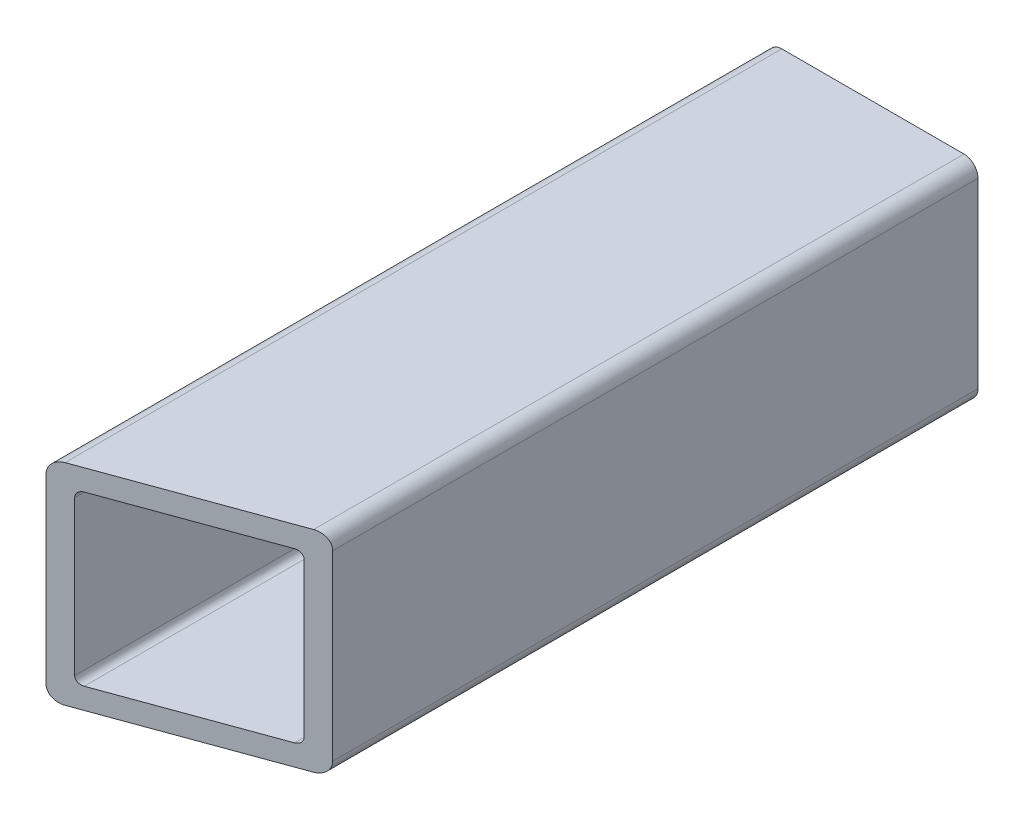
ISO-10303-21;
HEADER;
FILE_DESCRIPTION(('STEP AP214'),'2;1');
FILE_NAME('part.step','',(''),(''),'','','');
FILE_SCHEMA(('AUTOMOTIVE_DESIGN { 1 0 10303 214 1 1 1 1 }'));
ENDSEC;
DATA;
#1=APPLICATION_CONTEXT('core data for automotive mechanical design processes');
#2=APPLICATION_PROTOCOL_DEFINITION('international standard','automotive_design',2000,#1);
#3=PRODUCT_CONTEXT('',#1,'mechanical');
#4=PRODUCT('Part','Part','',(#3));
#5=PRODUCT_RELATED_PRODUCT_CATEGORY('part','',(#4));
#6=PRODUCT_DEFINITION_FORMATION('','',#4);
#7=PRODUCT_DEFINITION_CONTEXT('part definition',#1,'design');
#8=PRODUCT_DEFINITION('design','',#6,#7);
#9=PRODUCT_DEFINITION_SHAPE('','',#8);
#10=(LENGTH_UNIT() NAMED_UNIT(*) SI_UNIT(.MILLI.,.METRE.));
#11=(NAMED_UNIT(*) PLANE_ANGLE_UNIT() SI_UNIT($,.RADIAN.));
#12=(NAMED_UNIT(*) SI_UNIT($,.STERADIAN.) SOLID_ANGLE_UNIT());
#13=UNCERTAINTY_MEASURE_WITH_UNIT(LENGTH_MEASURE(1.E-05),#10,'distance_accuracy_value','');
#14=(GEOMETRIC_REPRESENTATION_CONTEXT(3) GLOBAL_UNCERTAINTY_ASSIGNED_CONTEXT((#13)) GLOBAL_UNIT_ASSIGNED_CONTEXT((#10,
#11,#12)) REPRESENTATION_CONTEXT('',''));
#15=CARTESIAN_POINT('',(0.,0.,0.));
#16=DIRECTION('',(0.,0.,1.));
#17=DIRECTION('',(1.,0.,0.));
#18=AXIS2_PLACEMENT_3D('',#15,#16,#17);
#19=CARTESIAN_POINT('',(-13.,-0.999999999999999,0.));
#20=DIRECTION('',(0.,0.,1.));
#21=DIRECTION('',(1.,0.,0.));
#22=AXIS2_PLACEMENT_3D('',#19,#20,#21);
#23=PLANE('',#22);
#24=CARTESIAN_POINT('',(-13.,-0.999999999999999,0.));
#25=DIRECTION('',(0.,0.,1.));
#26=DIRECTION('',(1.,0.,0.));
#27=AXIS2_PLACEMENT_3D('',#24,#25,#26);
#28=CIRCLE('',#27,2.);
#29=CARTESIAN_POINT('',(-15.,-0.999999999999999,0.));
#30=VERTEX_POINT('',#29);
#31=CARTESIAN_POINT('',(-13.,-3.,0.));
#32=VERTEX_POINT('',#31);
#33=EDGE_CURVE('E172',#30,#32,#28,.T.);
#34=ORIENTED_EDGE('',*,*,#33,.F.);
#35=DIRECTION('',(0.,-1.,0.));
#36=VECTOR('',#35,1.);
#37=CARTESIAN_POINT('',(-15.,-0.999999999999999,0.));
#38=LINE('',#37,#36);
#39=CARTESIAN_POINT('',(-15.,25.,0.));
#40=VERTEX_POINT('',#39);
#41=EDGE_CURVE('E188',#40,#30,#38,.T.);
#42=ORIENTED_EDGE('',*,*,#41,.F.);
#43=CARTESIAN_POINT('',(-13.,25.,0.));
#44=DIRECTION('',(0.,0.,1.));
#45=DIRECTION('',(1.,0.,0.));
#46=AXIS2_PLACEMENT_3D('',#43,#44,#45);
#47=CIRCLE('',#46,2.);
#48=CARTESIAN_POINT('',(-13.,27.,0.));
#49=VERTEX_POINT('',#48);
#50=EDGE_CURVE('E190',#49,#40,#47,.T.);
#51=ORIENTED_EDGE('',*,*,#50,.F.);
#52=DIRECTION('',(-1.,0.,0.));
#53=VECTOR('',#52,1.);
#54=CARTESIAN_POINT('',(-13.,27.,0.));
#55=LINE('',#54,#53);
#56=CARTESIAN_POINT('',(13.,27.,0.));
#57=VERTEX_POINT('',#56);
#58=EDGE_CURVE('E192',#57,#49,#55,.T.);
#59=ORIENTED_EDGE('',*,*,#58,.F.);
#60=CARTESIAN_POINT('',(13.,25.,0.));
#61=DIRECTION('',(0.,0.,1.));
#62=DIRECTION('',(1.,0.,0.));
#63=AXIS2_PLACEMENT_3D('',#60,#61,#62);
#64=CIRCLE('',#63,2.);
#65=CARTESIAN_POINT('',(15.,25.,0.));
#66=VERTEX_POINT('',#65);
#67=EDGE_CURVE('E195',#66,#57,#64,.T.);
#68=ORIENTED_EDGE('',*,*,#67,.F.);
#69=DIRECTION('',(0.,1.,0.));
#70=VECTOR('',#69,1.);
#71=CARTESIAN_POINT('',(15.,-0.999999999999999,0.));
#72=LINE('',#71,#70);
#73=CARTESIAN_POINT('',(15.,-0.999999999999999,0.));
#74=VERTEX_POINT('',#73);
#75=EDGE_CURVE('E198',#74,#66,#72,.T.);
#76=ORIENTED_EDGE('',*,*,#75,.F.);
#77=CARTESIAN_POINT('',(13.,-0.999999999999999,0.));
#78=DIRECTION('',(0.,0.,1.));
#79=DIRECTION('',(1.,0.,0.));
#80=AXIS2_PLACEMENT_3D('',#77,#78,#79);
#81=CIRCLE('',#80,2.);
#82=CARTESIAN_POINT('',(13.,-3.,0.));
#83=VERTEX_POINT('',#82);
#84=EDGE_CURVE('E201',#83,#74,#81,.T.);
#85=ORIENTED_EDGE('',*,*,#84,.F.);
#86=DIRECTION('',(1.,0.,0.));
#87=VECTOR('',#86,1.);
#88=CARTESIAN_POINT('',(-13.,-3.,0.));
#89=LINE('',#88,#87);
#90=EDGE_CURVE('E204',#32,#83,#89,.T.);
#91=ORIENTED_EDGE('',*,*,#90,.F.);
#92=EDGE_LOOP('',(#34,#42,#51,#59,#68,#76,#85,#91));
#93=FACE_BOUND('',#92,.T.);
#94=CARTESIAN_POINT('',(-11.,1.,0.));
#95=DIRECTION('',(0.,0.,1.));
#96=DIRECTION('',(1.,0.,0.));
#97=AXIS2_PLACEMENT_3D('',#94,#95,#96);
#98=CIRCLE('',#97,1.);
#99=CARTESIAN_POINT('',(-12.,1.,0.));
#100=VERTEX_POINT('',#99);
#101=CARTESIAN_POINT('',(-11.,0.,0.));
#102=VERTEX_POINT('',#101);
#103=EDGE_CURVE('E159',#100,#102,#98,.T.);
#104=ORIENTED_EDGE('',*,*,#103,.T.);
#105=DIRECTION('',(1.,0.,0.));
#106=VECTOR('',#105,1.);
#107=CARTESIAN_POINT('',(-11.,0.,0.));
#108=LINE('',#107,#106);
#109=CARTESIAN_POINT('',(11.,0.,0.));
#110=VERTEX_POINT('',#109);
#111=EDGE_CURVE('E241',#102,#110,#108,.T.);
#112=ORIENTED_EDGE('',*,*,#111,.T.);
#113=CARTESIAN_POINT('',(11.,1.,0.));
#114=DIRECTION('',(0.,0.,1.));
#115=DIRECTION('',(1.,0.,0.));
#116=AXIS2_PLACEMENT_3D('',#113,#114,#115);
#117=CIRCLE('',#116,1.);
#118=CARTESIAN_POINT('',(12.,1.,0.));
#119=VERTEX_POINT('',#118);
#120=EDGE_CURVE('E238',#110,#119,#117,.T.);
#121=ORIENTED_EDGE('',*,*,#120,.T.);
#122=DIRECTION('',(0.,1.,0.));
#123=VECTOR('',#122,1.);
#124=CARTESIAN_POINT('',(12.,1.,0.));
#125=LINE('',#124,#123);
#126=CARTESIAN_POINT('',(12.,23.,0.));
#127=VERTEX_POINT('',#126);
#128=EDGE_CURVE('E235',#119,#127,#125,.T.);
#129=ORIENTED_EDGE('',*,*,#128,.T.);
#130=CARTESIAN_POINT('',(11.,23.,0.));
#131=DIRECTION('',(0.,0.,1.));
#132=DIRECTION('',(1.,0.,0.));
#133=AXIS2_PLACEMENT_3D('',#130,#131,#132);
#134=CIRCLE('',#133,1.);
#135=CARTESIAN_POINT('',(11.,24.,0.));
#136=VERTEX_POINT('',#135);
#137=EDGE_CURVE('E232',#127,#136,#134,.T.);
#138=ORIENTED_EDGE('',*,*,#137,.T.);
#139=DIRECTION('',(-1.,0.,0.));
#140=VECTOR('',#139,1.);
#141=CARTESIAN_POINT('',(-11.,24.,0.));
#142=LINE('',#141,#140);
#143=CARTESIAN_POINT('',(-11.,24.,0.));
#144=VERTEX_POINT('',#143);
#145=EDGE_CURVE('E229',#136,#144,#142,.T.);
#146=ORIENTED_EDGE('',*,*,#145,.T.);
#147=CARTESIAN_POINT('',(-11.,23.,0.));
#148=DIRECTION('',(0.,0.,1.));
#149=DIRECTION('',(1.,0.,0.));
#150=AXIS2_PLACEMENT_3D('',#147,#148,#149);
#151=CIRCLE('',#150,1.);
#152=CARTESIAN_POINT('',(-12.,23.,0.));
#153=VERTEX_POINT('',#152);
#154=EDGE_CURVE('E226',#144,#153,#151,.T.);
#155=ORIENTED_EDGE('',*,*,#154,.T.);
#156=DIRECTION('',(0.,-1.,0.));
#157=VECTOR('',#156,1.);
#158=CARTESIAN_POINT('',(-12.,1.,0.));
#159=LINE('',#158,#157);
#160=EDGE_CURVE('E223',#153,#100,#159,.T.);
#161=ORIENTED_EDGE('',*,*,#160,.T.);
#162=EDGE_LOOP('',(#104,#112,#121,#129,#138,#146,#155,#161));
#163=FACE_BOUND('',#162,.T.);
#164=ADVANCED_FACE('F36',(#93,#163),#23,.F.);
#165=CARTESIAN_POINT('',(-13.,-0.999999999999999,103.));
#166=DIRECTION('',(0.,0.,-1.));
#167=DIRECTION('',(-1.,0.,0.));
#168=AXIS2_PLACEMENT_3D('',#165,#166,#167);
#169=CYLINDRICAL_SURFACE('',#168,2.);
#170=DIRECTION('',(0.,0.,-1.));
#171=VECTOR('',#170,1.);
#172=CARTESIAN_POINT('',(-13.,-3.,103.));
#173=LINE('',#172,#171);
#174=CARTESIAN_POINT('',(-13.,-3.,102.272059531468));
#175=VERTEX_POINT('',#174);
#176=EDGE_CURVE('E44',#175,#32,#173,.T.);
#177=ORIENTED_EDGE('',*,*,#176,.F.);
#178=CARTESIAN_POINT('',(-13.,-0.999999999999999,102.272059531468));
#179=DIRECTION('',(-0.342020143325669,0.,-0.939692620785908));
#180=DIRECTION('',(0.939692620785908,0.,-0.342020143325669));
#181=AXIS2_PLACEMENT_3D('',#178,#179,#180);
#182=ELLIPSE('',#181,2.12835554495182,2.);
#183=CARTESIAN_POINT('',(-15.,-1.,103.));
#184=VERTEX_POINT('',#183);
#185=EDGE_CURVE('E148',#175,#184,#182,.T.);
#186=ORIENTED_EDGE('',*,*,#185,.T.);
#187=DIRECTION('',(0.,0.,-1.));
#188=VECTOR('',#187,1.);
#189=CARTESIAN_POINT('',(-15.,-0.999999999999999,103.));
#190=LINE('',#189,#188);
#191=EDGE_CURVE('E186',#184,#30,#190,.T.);
#192=ORIENTED_EDGE('',*,*,#191,.T.);
#193=ORIENTED_EDGE('',*,*,#33,.T.);
#194=EDGE_LOOP('',(#177,#186,#192,#193));
#195=FACE_BOUND('',#194,.T.);
#196=ADVANCED_FACE('F38',(#195),#169,.T.);
#197=CARTESIAN_POINT('',(-13.,-3.,103.));
#198=DIRECTION('',(0.,1.,0.));
#199=DIRECTION('',(0.,0.,1.));
#200=AXIS2_PLACEMENT_3D('',#197,#198,#199);
#201=PLANE('',#200);
#202=DIRECTION('',(0.,0.,-1.));
#203=VECTOR('',#202,1.);
#204=CARTESIAN_POINT('',(13.,-3.,103.));
#205=LINE('',#204,#203);
#206=CARTESIAN_POINT('',(13.,-3.,92.8088334405463));
#207=VERTEX_POINT('',#206);
#208=EDGE_CURVE('E167',#207,#83,#205,.T.);
#209=ORIENTED_EDGE('',*,*,#208,.F.);
#210=DIRECTION('',(0.939692620785908,0.,-0.342020143325669));
#211=VECTOR('',#210,1.);
#212=CARTESIAN_POINT('',(-15.,-3.,103.));
#213=LINE('',#212,#211);
#214=EDGE_CURVE('E151',#175,#207,#213,.T.);
#215=ORIENTED_EDGE('',*,*,#214,.F.);
#216=ORIENTED_EDGE('',*,*,#176,.T.);
#217=ORIENTED_EDGE('',*,*,#90,.T.);
#218=EDGE_LOOP('',(#209,#215,#216,#217));
#219=FACE_BOUND('',#218,.T.);
#220=ADVANCED_FACE('F164',(#219),#201,.F.);
#221=CARTESIAN_POINT('',(13.,-0.999999999999999,103.));
#222=DIRECTION('',(0.,0.,-1.));
#223=DIRECTION('',(-1.,0.,0.));
#224=AXIS2_PLACEMENT_3D('',#221,#222,#223);
#225=CYLINDRICAL_SURFACE('',#224,2.);
#226=DIRECTION('',(0.,0.,-1.));
#227=VECTOR('',#226,1.);
#228=CARTESIAN_POINT('',(15.,-0.999999999999999,103.));
#229=LINE('',#228,#227);
#230=CARTESIAN_POINT('',(15.,-0.999999999999999,92.0808929720139));
#231=VERTEX_POINT('',#230);
#232=EDGE_CURVE('E173',#231,#74,#229,.T.);
#233=ORIENTED_EDGE('',*,*,#232,.F.);
#234=CARTESIAN_POINT('',(13.,-0.999999999999999,92.8088334405463));
#235=DIRECTION('',(-0.342020143325669,0.,-0.939692620785908));
#236=DIRECTION('',(0.939692620785908,0.,-0.342020143325669));
#237=AXIS2_PLACEMENT_3D('',#234,#235,#236);
#238=ELLIPSE('',#237,2.12835554495183,2.);
#239=EDGE_CURVE('E160',#231,#207,#238,.T.);
#240=ORIENTED_EDGE('',*,*,#239,.T.);
#241=ORIENTED_EDGE('',*,*,#208,.T.);
#242=ORIENTED_EDGE('',*,*,#84,.T.);
#243=EDGE_LOOP('',(#233,#240,#241,#242));
#244=FACE_BOUND('',#243,.T.);
#245=ADVANCED_FACE('F341',(#244),#225,.T.);
#246=CARTESIAN_POINT('',(15.,-0.999999999999999,103.));
#247=DIRECTION('',(-1.,0.,0.));
#248=DIRECTION('',(0.,0.,1.));
#249=AXIS2_PLACEMENT_3D('',#246,#247,#248);
#250=PLANE('',#249);
#251=DIRECTION('',(0.,0.,-1.));
#252=VECTOR('',#251,1.);
#253=CARTESIAN_POINT('',(15.,25.,103.));
#254=LINE('',#253,#252);
#255=CARTESIAN_POINT('',(15.,25.,92.0808929720139));
#256=VERTEX_POINT('',#255);
#257=EDGE_CURVE('E177',#256,#66,#254,.T.);
#258=ORIENTED_EDGE('',*,*,#257,.F.);
#259=DIRECTION('',(0.,-1.,0.));
#260=VECTOR('',#259,1.);
#261=CARTESIAN_POINT('',(15.,-0.999999999999999,92.0808929720139));
#262=LINE('',#261,#260);
#263=EDGE_CURVE('E247',#256,#231,#262,.T.);
#264=ORIENTED_EDGE('',*,*,#263,.T.);
#265=ORIENTED_EDGE('',*,*,#232,.T.);
#266=ORIENTED_EDGE('',*,*,#75,.T.);
#267=EDGE_LOOP('',(#258,#264,#265,#266));
#268=FACE_BOUND('',#267,.T.);
#269=ADVANCED_FACE('F337',(#268),#250,.F.);
#270=CARTESIAN_POINT('',(13.,25.,103.));
#271=DIRECTION('',(0.,0.,-1.));
#272=DIRECTION('',(-1.,0.,0.));
#273=AXIS2_PLACEMENT_3D('',#270,#271,#272);
#274=CYLINDRICAL_SURFACE('',#273,2.);
#275=DIRECTION('',(0.,0.,-1.));
#276=VECTOR('',#275,1.);
#277=CARTESIAN_POINT('',(13.,27.,103.));
#278=LINE('',#277,#276);
#279=CARTESIAN_POINT('',(13.,27.,92.8088334405463));
#280=VERTEX_POINT('',#279);
#281=EDGE_CURVE('E179',#280,#57,#278,.T.);
#282=ORIENTED_EDGE('',*,*,#281,.F.);
#283=CARTESIAN_POINT('',(13.,25.,92.8088334405463));
#284=DIRECTION('',(-0.342020143325669,0.,-0.939692620785908));
#285=DIRECTION('',(0.939692620785908,0.,-0.342020143325669));
#286=AXIS2_PLACEMENT_3D('',#283,#284,#285);
#287=ELLIPSE('',#286,2.12835554495183,2.);
#288=EDGE_CURVE('E250',#280,#256,#287,.T.);
#289=ORIENTED_EDGE('',*,*,#288,.T.);
#290=ORIENTED_EDGE('',*,*,#257,.T.);
#291=ORIENTED_EDGE('',*,*,#67,.T.);
#292=EDGE_LOOP('',(#282,#289,#290,#291));
#293=FACE_BOUND('',#292,.T.);
#294=ADVANCED_FACE('F333',(#293),#274,.T.);
#295=CARTESIAN_POINT('',(-13.,27.,103.));
#296=DIRECTION('',(0.,-1.,0.));
#297=DIRECTION('',(0.,0.,-1.));
#298=AXIS2_PLACEMENT_3D('',#295,#296,#297);
#299=PLANE('',#298);
#300=DIRECTION('',(0.,0.,-1.));
#301=VECTOR('',#300,1.);
#302=CARTESIAN_POINT('',(-13.,27.,103.));
#303=LINE('',#302,#301);
#304=CARTESIAN_POINT('',(-13.,27.,102.272059531468));
#305=VERTEX_POINT('',#304);
#306=EDGE_CURVE('E181',#305,#49,#303,.T.);
#307=ORIENTED_EDGE('',*,*,#306,.F.);
#308=DIRECTION('',(0.939692620785908,0.,-0.342020143325669));
#309=VECTOR('',#308,1.);
#310=CARTESIAN_POINT('',(-13.233955556881,27.,102.357212390313));
#311=LINE('',#310,#309);
#312=EDGE_CURVE('E253',#305,#280,#311,.T.);
#313=ORIENTED_EDGE('',*,*,#312,.T.);
#314=ORIENTED_EDGE('',*,*,#281,.T.);
#315=ORIENTED_EDGE('',*,*,#58,.T.);
#316=EDGE_LOOP('',(#307,#313,#314,#315));
#317=FACE_BOUND('',#316,.T.);
#318=ADVANCED_FACE('F329',(#317),#299,.F.);
#319=CARTESIAN_POINT('',(-13.,25.,103.));
#320=DIRECTION('',(0.,0.,-1.));
#321=DIRECTION('',(-1.,0.,0.));
#322=AXIS2_PLACEMENT_3D('',#319,#320,#321);
#323=CYLINDRICAL_SURFACE('',#322,2.);
#324=DIRECTION('',(0.,0.,-1.));
#325=VECTOR('',#324,1.);
#326=CARTESIAN_POINT('',(-15.,25.,103.));
#327=LINE('',#326,#325);
#328=CARTESIAN_POINT('',(-15.,25.,103.));
#329=VERTEX_POINT('',#328);
#330=EDGE_CURVE('E183',#329,#40,#327,.T.);
#331=ORIENTED_EDGE('',*,*,#330,.F.);
#332=CARTESIAN_POINT('',(-13.,25.,102.272059531468));
#333=DIRECTION('',(-0.342020143325669,0.,-0.939692620785908));
#334=DIRECTION('',(0.939692620785908,0.,-0.342020143325669));
#335=AXIS2_PLACEMENT_3D('',#332,#333,#334);
#336=ELLIPSE('',#335,2.12835554495183,2.);
#337=EDGE_CURVE('E256',#329,#305,#336,.T.);
#338=ORIENTED_EDGE('',*,*,#337,.T.);
#339=ORIENTED_EDGE('',*,*,#306,.T.);
#340=ORIENTED_EDGE('',*,*,#50,.T.);
#341=EDGE_LOOP('',(#331,#338,#339,#340));
#342=FACE_BOUND('',#341,.T.);
#343=ADVANCED_FACE('F325',(#342),#323,.T.);
#344=CARTESIAN_POINT('',(-15.,-0.999999999999999,103.));
#345=DIRECTION('',(1.,0.,0.));
#346=DIRECTION('',(0.,0.,-1.));
#347=AXIS2_PLACEMENT_3D('',#344,#345,#346);
#348=PLANE('',#347);
#349=ORIENTED_EDGE('',*,*,#41,.T.);
#350=ORIENTED_EDGE('',*,*,#191,.F.);
#351=DIRECTION('',(0.,-1.,0.));
#352=VECTOR('',#351,1.);
#353=CARTESIAN_POINT('',(-15.,-0.999999999999999,103.));
#354=LINE('',#353,#352);
#355=EDGE_CURVE('E154',#329,#184,#354,.T.);
#356=ORIENTED_EDGE('',*,*,#355,.F.);
#357=ORIENTED_EDGE('',*,*,#330,.T.);
#358=EDGE_LOOP('',(#349,#350,#356,#357));
#359=FACE_BOUND('',#358,.T.);
#360=ADVANCED_FACE('F322',(#359),#348,.F.);
#361=CARTESIAN_POINT('',(-11.,1.,103.));
#362=DIRECTION('',(0.,0.,-1.));
#363=DIRECTION('',(-1.,0.,0.));
#364=AXIS2_PLACEMENT_3D('',#361,#362,#363);
#365=CYLINDRICAL_SURFACE('',#364,1.);
#366=CARTESIAN_POINT('',(-11.,1.,101.544119062935));
#367=DIRECTION('',(-0.342020143325669,0.,-0.939692620785908));
#368=DIRECTION('',(0.939692620785908,0.,-0.342020143325669));
#369=AXIS2_PLACEMENT_3D('',#366,#367,#368);
#370=ELLIPSE('',#369,1.06417777247591,1.);
#371=CARTESIAN_POINT('',(-11.,0.,101.544119062935));
#372=VERTEX_POINT('',#371);
#373=CARTESIAN_POINT('',(-12.,1.,101.908089297201));
#374=VERTEX_POINT('',#373);
#375=EDGE_CURVE('E50',#372,#374,#370,.T.);
#376=ORIENTED_EDGE('',*,*,#375,.F.);
#377=DIRECTION('',(0.,0.,-1.));
#378=VECTOR('',#377,1.);
#379=CARTESIAN_POINT('',(-11.,0.,103.));
#380=LINE('',#379,#378);
#381=EDGE_CURVE('E207',#372,#102,#380,.T.);
#382=ORIENTED_EDGE('',*,*,#381,.T.);
#383=ORIENTED_EDGE('',*,*,#103,.F.);
#384=DIRECTION('',(0.,0.,-1.));
#385=VECTOR('',#384,1.);
#386=CARTESIAN_POINT('',(-12.,1.,103.));
#387=LINE('',#386,#385);
#388=EDGE_CURVE('E57',#374,#100,#387,.T.);
#389=ORIENTED_EDGE('',*,*,#388,.F.);
#390=EDGE_LOOP('',(#376,#382,#383,#389));
#391=FACE_BOUND('',#390,.T.);
#392=ADVANCED_FACE('F303',(#391),#365,.F.);
#393=CARTESIAN_POINT('',(-11.,0.,103.));
#394=DIRECTION('',(0.,1.,0.));
#395=DIRECTION('',(-1.,0.,0.));
#396=AXIS2_PLACEMENT_3D('',#393,#394,#395);
#397=PLANE('',#396);
#398=DIRECTION('',(-0.939692620785908,0.,0.342020143325669));
#399=VECTOR('',#398,1.);
#400=CARTESIAN_POINT('',(-11.467911113762,0.,101.714424780627));
#401=LINE('',#400,#399);
#402=CARTESIAN_POINT('',(11.,0.,93.5367739090787));
#403=VERTEX_POINT('',#402);
#404=EDGE_CURVE('E260',#403,#372,#401,.T.);
#405=ORIENTED_EDGE('',*,*,#404,.F.);
#406=DIRECTION('',(0.,0.,-1.));
#407=VECTOR('',#406,1.);
#408=CARTESIAN_POINT('',(11.,0.,103.));
#409=LINE('',#408,#407);
#410=EDGE_CURVE('E210',#403,#110,#409,.T.);
#411=ORIENTED_EDGE('',*,*,#410,.T.);
#412=ORIENTED_EDGE('',*,*,#111,.F.);
#413=ORIENTED_EDGE('',*,*,#381,.F.);
#414=EDGE_LOOP('',(#405,#411,#412,#413));
#415=FACE_BOUND('',#414,.T.);
#416=ADVANCED_FACE('F300',(#415),#397,.T.);
#417=CARTESIAN_POINT('',(11.,1.,103.));
#418=DIRECTION('',(0.,0.,-1.));
#419=DIRECTION('',(-1.,0.,0.));
#420=AXIS2_PLACEMENT_3D('',#417,#418,#419);
#421=CYLINDRICAL_SURFACE('',#420,1.);
#422=CARTESIAN_POINT('',(11.,1.,93.5367739090787));
#423=DIRECTION('',(-0.342020143325669,0.,-0.939692620785908));
#424=DIRECTION('',(0.939692620785908,0.,-0.342020143325669));
#425=AXIS2_PLACEMENT_3D('',#422,#423,#424);
#426=ELLIPSE('',#425,1.06417777247591,1.);
#427=CARTESIAN_POINT('',(12.,1.,93.1728036748125));
#428=VERTEX_POINT('',#427);
#429=EDGE_CURVE('E262',#428,#403,#426,.T.);
#430=ORIENTED_EDGE('',*,*,#429,.F.);
#431=DIRECTION('',(0.,0.,-1.));
#432=VECTOR('',#431,1.);
#433=CARTESIAN_POINT('',(12.,1.,103.));
#434=LINE('',#433,#432);
#435=EDGE_CURVE('E212',#428,#119,#434,.T.);
#436=ORIENTED_EDGE('',*,*,#435,.T.);
#437=ORIENTED_EDGE('',*,*,#120,.F.);
#438=ORIENTED_EDGE('',*,*,#410,.F.);
#439=EDGE_LOOP('',(#430,#436,#437,#438));
#440=FACE_BOUND('',#439,.T.);
#441=ADVANCED_FACE('F295',(#440),#421,.F.);
#442=CARTESIAN_POINT('',(12.,1.,103.));
#443=DIRECTION('',(-1.,0.,0.));
#444=DIRECTION('',(0.,-1.,0.));
#445=AXIS2_PLACEMENT_3D('',#442,#443,#444);
#446=PLANE('',#445);
#447=DIRECTION('',(0.,-1.,0.));
#448=VECTOR('',#447,1.);
#449=CARTESIAN_POINT('',(12.,1.00000000000001,93.1728036748125));
#450=LINE('',#449,#448);
#451=CARTESIAN_POINT('',(12.,23.,93.1728036748125));
#452=VERTEX_POINT('',#451);
#453=EDGE_CURVE('E264',#452,#428,#450,.T.);
#454=ORIENTED_EDGE('',*,*,#453,.F.);
#455=DIRECTION('',(0.,0.,-1.));
#456=VECTOR('',#455,1.);
#457=CARTESIAN_POINT('',(12.,23.,103.));
#458=LINE('',#457,#456);
#459=EDGE_CURVE('E214',#452,#127,#458,.T.);
#460=ORIENTED_EDGE('',*,*,#459,.T.);
#461=ORIENTED_EDGE('',*,*,#128,.F.);
#462=ORIENTED_EDGE('',*,*,#435,.F.);
#463=EDGE_LOOP('',(#454,#460,#461,#462));
#464=FACE_BOUND('',#463,.T.);
#465=ADVANCED_FACE('F292',(#464),#446,.T.);
#466=CARTESIAN_POINT('',(11.,23.,103.));
#467=DIRECTION('',(0.,0.,-1.));
#468=DIRECTION('',(-1.,0.,0.));
#469=AXIS2_PLACEMENT_3D('',#466,#467,#468);
#470=CYLINDRICAL_SURFACE('',#469,1.);
#471=CARTESIAN_POINT('',(11.,23.,93.5367739090787));
#472=DIRECTION('',(-0.342020143325669,0.,-0.939692620785908));
#473=DIRECTION('',(0.939692620785908,0.,-0.342020143325669));
#474=AXIS2_PLACEMENT_3D('',#471,#472,#473);
#475=ELLIPSE('',#474,1.06417777247592,1.);
#476=CARTESIAN_POINT('',(11.,24.,93.5367739090787));
#477=VERTEX_POINT('',#476);
#478=EDGE_CURVE('E266',#477,#452,#475,.T.);
#479=ORIENTED_EDGE('',*,*,#478,.F.);
#480=DIRECTION('',(0.,0.,-1.));
#481=VECTOR('',#480,1.);
#482=CARTESIAN_POINT('',(11.,24.,103.));
#483=LINE('',#482,#481);
#484=EDGE_CURVE('E216',#477,#136,#483,.T.);
#485=ORIENTED_EDGE('',*,*,#484,.T.);
#486=ORIENTED_EDGE('',*,*,#137,.F.);
#487=ORIENTED_EDGE('',*,*,#459,.F.);
#488=EDGE_LOOP('',(#479,#485,#486,#487));
#489=FACE_BOUND('',#488,.T.);
#490=ADVANCED_FACE('F287',(#489),#470,.F.);
#491=CARTESIAN_POINT('',(-11.,24.,103.));
#492=DIRECTION('',(0.,-1.,0.));
#493=DIRECTION('',(1.,0.,0.));
#494=AXIS2_PLACEMENT_3D('',#491,#492,#493);
#495=PLANE('',#494);
#496=DIRECTION('',(0.939692620785908,0.,-0.342020143325669));
#497=VECTOR('',#496,1.);
#498=CARTESIAN_POINT('',(-11.467911113762,24.,101.714424780627));
#499=LINE('',#498,#497);
#500=CARTESIAN_POINT('',(-11.,24.,101.544119062935));
#501=VERTEX_POINT('',#500);
#502=EDGE_CURVE('E268',#501,#477,#499,.T.);
#503=ORIENTED_EDGE('',*,*,#502,.F.);
#504=DIRECTION('',(0.,0.,-1.));
#505=VECTOR('',#504,1.);
#506=CARTESIAN_POINT('',(-11.,24.,103.));
#507=LINE('',#506,#505);
#508=EDGE_CURVE('E218',#501,#144,#507,.T.);
#509=ORIENTED_EDGE('',*,*,#508,.T.);
#510=ORIENTED_EDGE('',*,*,#145,.F.);
#511=ORIENTED_EDGE('',*,*,#484,.F.);
#512=EDGE_LOOP('',(#503,#509,#510,#511));
#513=FACE_BOUND('',#512,.T.);
#514=ADVANCED_FACE('F278',(#513),#495,.T.);
#515=CARTESIAN_POINT('',(-11.,23.,103.));
#516=DIRECTION('',(0.,0.,-1.));
#517=DIRECTION('',(-1.,0.,0.));
#518=AXIS2_PLACEMENT_3D('',#515,#516,#517);
#519=CYLINDRICAL_SURFACE('',#518,1.);
#520=CARTESIAN_POINT('',(-11.,23.,101.544119062935));
#521=DIRECTION('',(-0.342020143325669,0.,-0.939692620785908));
#522=DIRECTION('',(0.939692620785908,0.,-0.342020143325669));
#523=AXIS2_PLACEMENT_3D('',#520,#521,#522);
#524=ELLIPSE('',#523,1.06417777247592,1.);
#525=CARTESIAN_POINT('',(-12.,23.,101.908089297201));
#526=VERTEX_POINT('',#525);
#527=EDGE_CURVE('E168',#526,#501,#524,.T.);
#528=ORIENTED_EDGE('',*,*,#527,.F.);
#529=DIRECTION('',(0.,0.,-1.));
#530=VECTOR('',#529,1.);
#531=CARTESIAN_POINT('',(-12.,23.,103.));
#532=LINE('',#531,#530);
#533=EDGE_CURVE('E220',#526,#153,#532,.T.);
#534=ORIENTED_EDGE('',*,*,#533,.T.);
#535=ORIENTED_EDGE('',*,*,#154,.F.);
#536=ORIENTED_EDGE('',*,*,#508,.F.);
#537=EDGE_LOOP('',(#528,#534,#535,#536));
#538=FACE_BOUND('',#537,.T.);
#539=ADVANCED_FACE('F281',(#538),#519,.F.);
#540=CARTESIAN_POINT('',(-12.,1.,103.));
#541=DIRECTION('',(1.,0.,0.));
#542=DIRECTION('',(0.,0.,-1.));
#543=AXIS2_PLACEMENT_3D('',#540,#541,#542);
#544=PLANE('',#543);
#545=DIRECTION('',(0.,1.,0.));
#546=VECTOR('',#545,1.);
#547=CARTESIAN_POINT('',(-12.,1.,101.908089297201));
#548=LINE('',#547,#546);
#549=EDGE_CURVE('E11',#374,#526,#548,.T.);
#550=ORIENTED_EDGE('',*,*,#549,.F.);
#551=ORIENTED_EDGE('',*,*,#388,.T.);
#552=ORIENTED_EDGE('',*,*,#160,.F.);
#553=ORIENTED_EDGE('',*,*,#533,.F.);
#554=EDGE_LOOP('',(#550,#551,#552,#553));
#555=FACE_BOUND('',#554,.T.);
#556=ADVANCED_FACE('F304',(#555),#544,.T.);
#557=CARTESIAN_POINT('',(-15.,67.,103.));
#558=DIRECTION('',(-0.342020143325669,0.,-0.939692620785908));
#559=DIRECTION('',(-0.939692620785908,0.,0.342020143325669));
#560=AXIS2_PLACEMENT_3D('',#557,#558,#559);
#561=PLANE('',#560);
#562=ORIENTED_EDGE('',*,*,#375,.T.);
#563=ORIENTED_EDGE('',*,*,#549,.T.);
#564=ORIENTED_EDGE('',*,*,#527,.T.);
#565=ORIENTED_EDGE('',*,*,#502,.T.);
#566=ORIENTED_EDGE('',*,*,#478,.T.);
#567=ORIENTED_EDGE('',*,*,#453,.T.);
#568=ORIENTED_EDGE('',*,*,#429,.T.);
#569=ORIENTED_EDGE('',*,*,#404,.T.);
#570=EDGE_LOOP('',(#562,#563,#564,#565,#566,#567,#568,#569));
#571=FACE_BOUND('',#570,.T.);
#572=ORIENTED_EDGE('',*,*,#214,.T.);
#573=ORIENTED_EDGE('',*,*,#239,.F.);
#574=ORIENTED_EDGE('',*,*,#263,.F.);
#575=ORIENTED_EDGE('',*,*,#288,.F.);
#576=ORIENTED_EDGE('',*,*,#312,.F.);
#577=ORIENTED_EDGE('',*,*,#337,.F.);
#578=ORIENTED_EDGE('',*,*,#355,.T.);
#579=ORIENTED_EDGE('',*,*,#185,.F.);
#580=EDGE_LOOP('',(#572,#573,#574,#575,#576,#577,#578,#579));
#581=FACE_BOUND('',#580,.T.);
#582=ADVANCED_FACE('F150',(#571,#581),#561,.F.);
#583=CLOSED_SHELL('',(#164,#196,#220,#245,#269,#294,#318,#343,#360,#392,#416,#441,#465,#490,
#514,#539,#556,#582));
#584=MANIFOLD_SOLID_BREP('B2',#583);
#585=ADVANCED_BREP_SHAPE_REPRESENTATION('',(#18,#584),#14);
#586=SHAPE_DEFINITION_REPRESENTATION(#9,#585);
ENDSEC;
END-ISO-10303-21;
